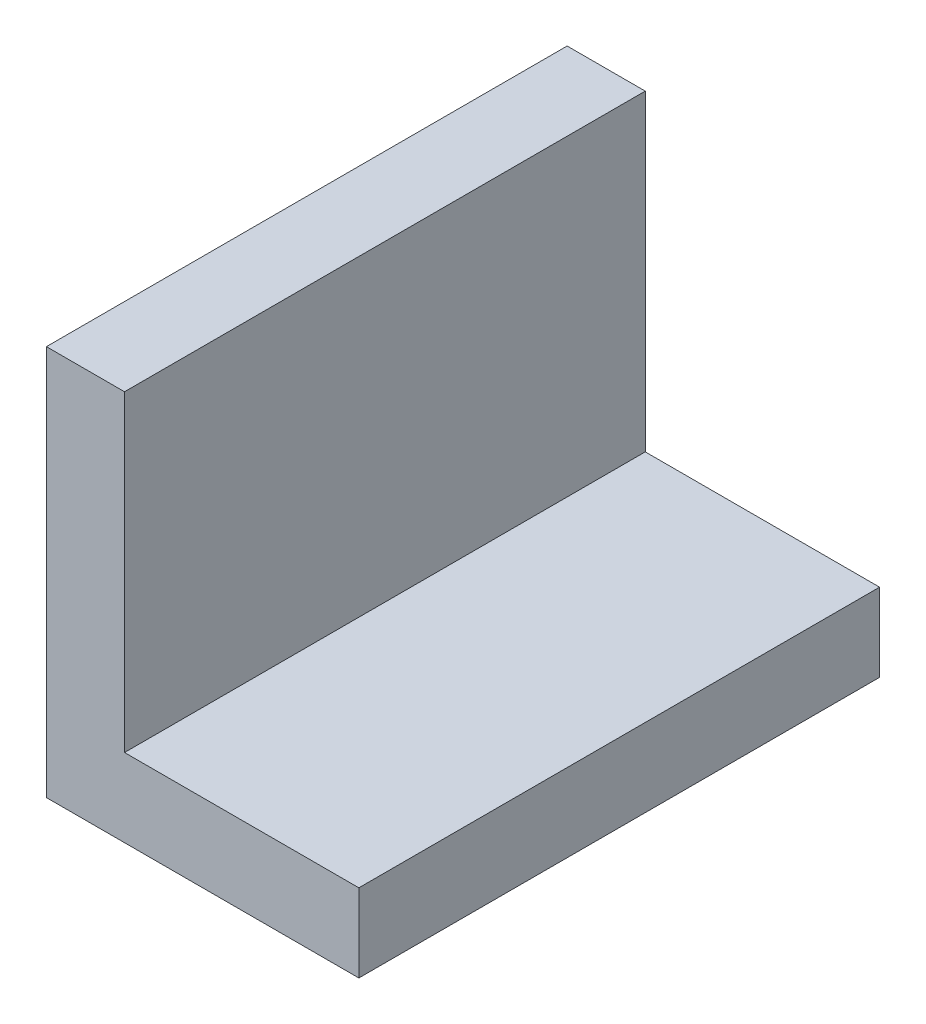
ISO-10303-21;
HEADER;
FILE_DESCRIPTION(('STEP AP214'),'2;1');
FILE_NAME('part.step','',(''),(''),'','','');
FILE_SCHEMA(('AUTOMOTIVE_DESIGN { 1 0 10303 214 1 1 1 1 }'));
ENDSEC;
DATA;
#1=APPLICATION_CONTEXT('core data for automotive mechanical design processes');
#2=APPLICATION_PROTOCOL_DEFINITION('international standard','automotive_design',2000,#1);
#3=PRODUCT_CONTEXT('',#1,'mechanical');
#4=PRODUCT('Part','Part','',(#3));
#5=PRODUCT_RELATED_PRODUCT_CATEGORY('part','',(#4));
#6=PRODUCT_DEFINITION_FORMATION('','',#4);
#7=PRODUCT_DEFINITION_CONTEXT('part definition',#1,'design');
#8=PRODUCT_DEFINITION('design','',#6,#7);
#9=PRODUCT_DEFINITION_SHAPE('','',#8);
#10=(LENGTH_UNIT() NAMED_UNIT(*) SI_UNIT(.MILLI.,.METRE.));
#11=(NAMED_UNIT(*) PLANE_ANGLE_UNIT() SI_UNIT($,.RADIAN.));
#12=(NAMED_UNIT(*) SI_UNIT($,.STERADIAN.) SOLID_ANGLE_UNIT());
#13=UNCERTAINTY_MEASURE_WITH_UNIT(LENGTH_MEASURE(1.E-05),#10,'distance_accuracy_value','');
#14=(GEOMETRIC_REPRESENTATION_CONTEXT(3) GLOBAL_UNCERTAINTY_ASSIGNED_CONTEXT((#13)) GLOBAL_UNIT_ASSIGNED_CONTEXT((#10,
#11,#12)) REPRESENTATION_CONTEXT('',''));
#15=CARTESIAN_POINT('',(0.,0.,0.));
#16=DIRECTION('',(0.,0.,1.));
#17=DIRECTION('',(1.,0.,0.));
#18=AXIS2_PLACEMENT_3D('',#15,#16,#17);
#19=CARTESIAN_POINT('',(0.,75.,100.));
#20=DIRECTION('',(1.,0.,0.));
#21=DIRECTION('',(0.,0.,-1.));
#22=AXIS2_PLACEMENT_3D('',#19,#20,#21);
#23=PLANE('',#22);
#24=DIRECTION('',(0.,-1.,0.));
#25=VECTOR('',#24,1.);
#26=CARTESIAN_POINT('',(0.,75.,0.));
#27=LINE('',#26,#25);
#28=CARTESIAN_POINT('',(0.,75.,0.));
#29=VERTEX_POINT('',#28);
#30=CARTESIAN_POINT('',(0.,0.,0.));
#31=VERTEX_POINT('',#30);
#32=EDGE_CURVE('E117',#29,#31,#27,.T.);
#33=ORIENTED_EDGE('',*,*,#32,.T.);
#34=DIRECTION('',(0.,0.,-1.));
#35=VECTOR('',#34,1.);
#36=CARTESIAN_POINT('',(0.,0.,100.));
#37=LINE('',#36,#35);
#38=CARTESIAN_POINT('',(0.,0.,100.));
#39=VERTEX_POINT('',#38);
#40=EDGE_CURVE('E11',#39,#31,#37,.T.);
#41=ORIENTED_EDGE('',*,*,#40,.F.);
#42=DIRECTION('',(0.,-1.,0.));
#43=VECTOR('',#42,1.);
#44=CARTESIAN_POINT('',(0.,75.,100.));
#45=LINE('',#44,#43);
#46=CARTESIAN_POINT('',(0.,75.,100.));
#47=VERTEX_POINT('',#46);
#48=EDGE_CURVE('E127',#47,#39,#45,.T.);
#49=ORIENTED_EDGE('',*,*,#48,.F.);
#50=DIRECTION('',(0.,0.,-1.));
#51=VECTOR('',#50,1.);
#52=CARTESIAN_POINT('',(0.,75.,100.));
#53=LINE('',#52,#51);
#54=EDGE_CURVE('E113',#47,#29,#53,.T.);
#55=ORIENTED_EDGE('',*,*,#54,.T.);
#56=EDGE_LOOP('',(#33,#41,#49,#55));
#57=FACE_BOUND('',#56,.T.);
#58=ADVANCED_FACE('F33',(#57),#23,.F.);
#59=CARTESIAN_POINT('',(0.,0.,100.));
#60=DIRECTION('',(0.,1.,0.));
#61=DIRECTION('',(0.,0.,1.));
#62=AXIS2_PLACEMENT_3D('',#59,#60,#61);
#63=PLANE('',#62);
#64=DIRECTION('',(1.,0.,0.));
#65=VECTOR('',#64,1.);
#66=CARTESIAN_POINT('',(0.,0.,0.));
#67=LINE('',#66,#65);
#68=CARTESIAN_POINT('',(60.,0.,0.));
#69=VERTEX_POINT('',#68);
#70=EDGE_CURVE('E120',#31,#69,#67,.T.);
#71=ORIENTED_EDGE('',*,*,#70,.T.);
#72=DIRECTION('',(0.,0.,-1.));
#73=VECTOR('',#72,1.);
#74=CARTESIAN_POINT('',(60.,0.,100.));
#75=LINE('',#74,#73);
#76=CARTESIAN_POINT('',(60.,0.,100.));
#77=VERTEX_POINT('',#76);
#78=EDGE_CURVE('E41',#77,#69,#75,.T.);
#79=ORIENTED_EDGE('',*,*,#78,.F.);
#80=DIRECTION('',(1.,0.,0.));
#81=VECTOR('',#80,1.);
#82=CARTESIAN_POINT('',(0.,0.,100.));
#83=LINE('',#82,#81);
#84=EDGE_CURVE('E86',#39,#77,#83,.T.);
#85=ORIENTED_EDGE('',*,*,#84,.F.);
#86=ORIENTED_EDGE('',*,*,#40,.T.);
#87=EDGE_LOOP('',(#71,#79,#85,#86));
#88=FACE_BOUND('',#87,.T.);
#89=ADVANCED_FACE('F151',(#88),#63,.F.);
#90=CARTESIAN_POINT('',(60.,0.,100.));
#91=DIRECTION('',(-1.,0.,0.));
#92=DIRECTION('',(0.,-1.,0.));
#93=AXIS2_PLACEMENT_3D('',#90,#91,#92);
#94=PLANE('',#93);
#95=DIRECTION('',(0.,1.,0.));
#96=VECTOR('',#95,1.);
#97=CARTESIAN_POINT('',(60.,0.,0.));
#98=LINE('',#97,#96);
#99=CARTESIAN_POINT('',(60.,15.,0.));
#100=VERTEX_POINT('',#99);
#101=EDGE_CURVE('E122',#69,#100,#98,.T.);
#102=ORIENTED_EDGE('',*,*,#101,.T.);
#103=DIRECTION('',(0.,0.,-1.));
#104=VECTOR('',#103,1.);
#105=CARTESIAN_POINT('',(60.,15.,100.));
#106=LINE('',#105,#104);
#107=CARTESIAN_POINT('',(60.,15.,100.));
#108=VERTEX_POINT('',#107);
#109=EDGE_CURVE('E108',#108,#100,#106,.T.);
#110=ORIENTED_EDGE('',*,*,#109,.F.);
#111=DIRECTION('',(0.,1.,0.));
#112=VECTOR('',#111,1.);
#113=CARTESIAN_POINT('',(60.,0.,100.));
#114=LINE('',#113,#112);
#115=EDGE_CURVE('E99',#77,#108,#114,.T.);
#116=ORIENTED_EDGE('',*,*,#115,.F.);
#117=ORIENTED_EDGE('',*,*,#78,.T.);
#118=EDGE_LOOP('',(#102,#110,#116,#117));
#119=FACE_BOUND('',#118,.T.);
#120=ADVANCED_FACE('F133',(#119),#94,.F.);
#121=CARTESIAN_POINT('',(60.,15.,100.));
#122=DIRECTION('',(0.,-1.,0.));
#123=DIRECTION('',(1.,0.,0.));
#124=AXIS2_PLACEMENT_3D('',#121,#122,#123);
#125=PLANE('',#124);
#126=DIRECTION('',(-1.,0.,0.));
#127=VECTOR('',#126,1.);
#128=CARTESIAN_POINT('',(60.,15.,0.));
#129=LINE('',#128,#127);
#130=CARTESIAN_POINT('',(15.,15.,0.));
#131=VERTEX_POINT('',#130);
#132=EDGE_CURVE('E107',#100,#131,#129,.T.);
#133=ORIENTED_EDGE('',*,*,#132,.T.);
#134=DIRECTION('',(0.,0.,-1.));
#135=VECTOR('',#134,1.);
#136=CARTESIAN_POINT('',(15.,15.,100.));
#137=LINE('',#136,#135);
#138=CARTESIAN_POINT('',(15.,15.,100.));
#139=VERTEX_POINT('',#138);
#140=EDGE_CURVE('E104',#139,#131,#137,.T.);
#141=ORIENTED_EDGE('',*,*,#140,.F.);
#142=DIRECTION('',(-1.,0.,0.));
#143=VECTOR('',#142,1.);
#144=CARTESIAN_POINT('',(60.,15.,100.));
#145=LINE('',#144,#143);
#146=EDGE_CURVE('E93',#108,#139,#145,.T.);
#147=ORIENTED_EDGE('',*,*,#146,.F.);
#148=ORIENTED_EDGE('',*,*,#109,.T.);
#149=EDGE_LOOP('',(#133,#141,#147,#148));
#150=FACE_BOUND('',#149,.T.);
#151=ADVANCED_FACE('F105',(#150),#125,.F.);
#152=CARTESIAN_POINT('',(15.,15.,100.));
#153=DIRECTION('',(-1.,0.,0.));
#154=DIRECTION('',(0.,-1.,0.));
#155=AXIS2_PLACEMENT_3D('',#152,#153,#154);
#156=PLANE('',#155);
#157=DIRECTION('',(0.,1.,0.));
#158=VECTOR('',#157,1.);
#159=CARTESIAN_POINT('',(15.,15.,0.));
#160=LINE('',#159,#158);
#161=CARTESIAN_POINT('',(15.,75.,0.));
#162=VERTEX_POINT('',#161);
#163=EDGE_CURVE('E72',#131,#162,#160,.T.);
#164=ORIENTED_EDGE('',*,*,#163,.T.);
#165=DIRECTION('',(0.,0.,-1.));
#166=VECTOR('',#165,1.);
#167=CARTESIAN_POINT('',(15.,75.,100.));
#168=LINE('',#167,#166);
#169=CARTESIAN_POINT('',(15.,75.,100.));
#170=VERTEX_POINT('',#169);
#171=EDGE_CURVE('E109',#170,#162,#168,.T.);
#172=ORIENTED_EDGE('',*,*,#171,.F.);
#173=DIRECTION('',(0.,1.,0.));
#174=VECTOR('',#173,1.);
#175=CARTESIAN_POINT('',(15.,15.,100.));
#176=LINE('',#175,#174);
#177=EDGE_CURVE('E97',#139,#170,#176,.T.);
#178=ORIENTED_EDGE('',*,*,#177,.F.);
#179=ORIENTED_EDGE('',*,*,#140,.T.);
#180=EDGE_LOOP('',(#164,#172,#178,#179));
#181=FACE_BOUND('',#180,.T.);
#182=ADVANCED_FACE('F111',(#181),#156,.F.);
#183=CARTESIAN_POINT('',(15.,75.,100.));
#184=DIRECTION('',(0.,-1.,0.));
#185=DIRECTION('',(0.,0.,-1.));
#186=AXIS2_PLACEMENT_3D('',#183,#184,#185);
#187=PLANE('',#186);
#188=DIRECTION('',(-1.,0.,0.));
#189=VECTOR('',#188,1.);
#190=CARTESIAN_POINT('',(15.,75.,0.));
#191=LINE('',#190,#189);
#192=EDGE_CURVE('E78',#162,#29,#191,.T.);
#193=ORIENTED_EDGE('',*,*,#192,.T.);
#194=ORIENTED_EDGE('',*,*,#54,.F.);
#195=DIRECTION('',(-1.,0.,0.));
#196=VECTOR('',#195,1.);
#197=CARTESIAN_POINT('',(15.,75.,100.));
#198=LINE('',#197,#196);
#199=EDGE_CURVE('E49',#170,#47,#198,.T.);
#200=ORIENTED_EDGE('',*,*,#199,.F.);
#201=ORIENTED_EDGE('',*,*,#171,.T.);
#202=EDGE_LOOP('',(#193,#194,#200,#201));
#203=FACE_BOUND('',#202,.T.);
#204=ADVANCED_FACE('F140',(#203),#187,.F.);
#205=CARTESIAN_POINT('',(0.,0.,100.));
#206=DIRECTION('',(0.,0.,1.));
#207=DIRECTION('',(1.,0.,0.));
#208=AXIS2_PLACEMENT_3D('',#205,#206,#207);
#209=PLANE('',#208);
#210=ORIENTED_EDGE('',*,*,#48,.T.);
#211=ORIENTED_EDGE('',*,*,#84,.T.);
#212=ORIENTED_EDGE('',*,*,#115,.T.);
#213=ORIENTED_EDGE('',*,*,#146,.T.);
#214=ORIENTED_EDGE('',*,*,#177,.T.);
#215=ORIENTED_EDGE('',*,*,#199,.T.);
#216=EDGE_LOOP('',(#210,#211,#212,#213,#214,#215));
#217=FACE_BOUND('',#216,.T.);
#218=ADVANCED_FACE('F95',(#217),#209,.T.);
#219=CARTESIAN_POINT('',(0.,0.,0.));
#220=DIRECTION('',(0.,0.,1.));
#221=DIRECTION('',(1.,0.,0.));
#222=AXIS2_PLACEMENT_3D('',#219,#220,#221);
#223=PLANE('',#222);
#224=ORIENTED_EDGE('',*,*,#32,.F.);
#225=ORIENTED_EDGE('',*,*,#192,.F.);
#226=ORIENTED_EDGE('',*,*,#163,.F.);
#227=ORIENTED_EDGE('',*,*,#132,.F.);
#228=ORIENTED_EDGE('',*,*,#101,.F.);
#229=ORIENTED_EDGE('',*,*,#70,.F.);
#230=EDGE_LOOP('',(#224,#225,#226,#227,#228,#229));
#231=FACE_BOUND('',#230,.T.);
#232=ADVANCED_FACE('F136',(#231),#223,.F.);
#233=CLOSED_SHELL('',(#58,#89,#120,#151,#182,#204,#218,#232));
#234=MANIFOLD_SOLID_BREP('B2',#233);
#235=ADVANCED_BREP_SHAPE_REPRESENTATION('',(#18,#234),#14);
#236=SHAPE_DEFINITION_REPRESENTATION(#9,#235);
ENDSEC;
END-ISO-10303-21;
